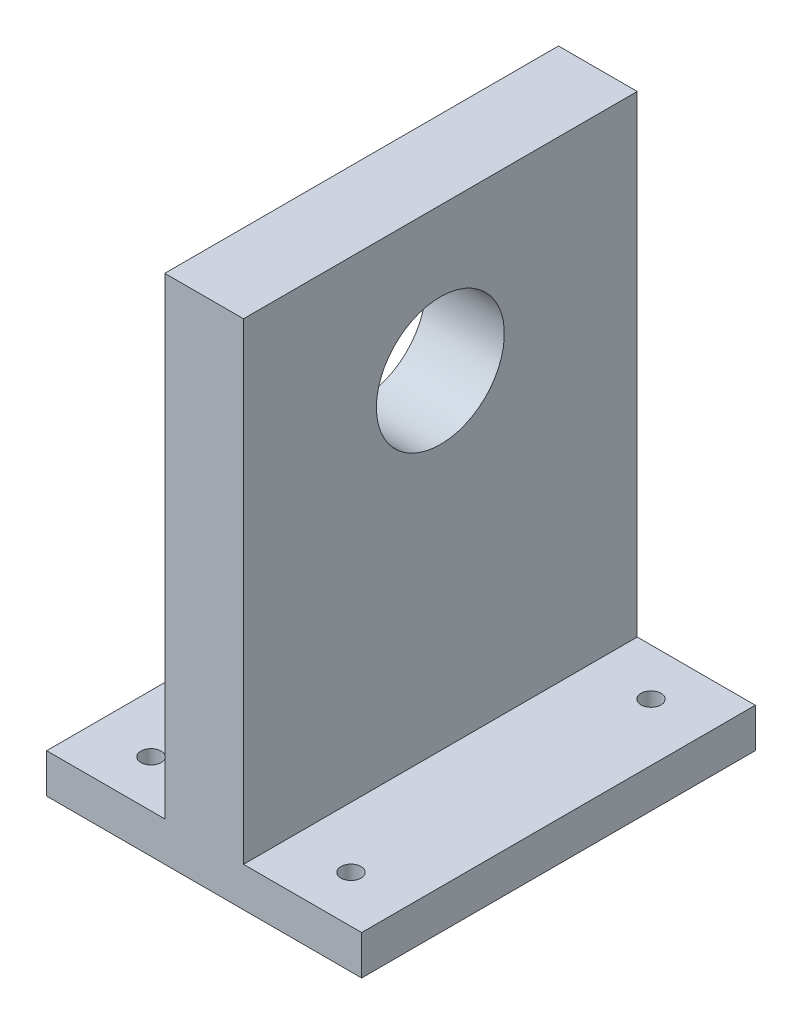
ISO-10303-21;
HEADER;
FILE_DESCRIPTION(('STEP AP214'),'2;1');
FILE_NAME('part.step','',(''),(''),'','','');
FILE_SCHEMA(('AUTOMOTIVE_DESIGN { 1 0 10303 214 1 1 1 1 }'));
ENDSEC;
DATA;
#1=APPLICATION_CONTEXT('core data for automotive mechanical design processes');
#2=APPLICATION_PROTOCOL_DEFINITION('international standard','automotive_design',2000,#1);
#3=PRODUCT_CONTEXT('',#1,'mechanical');
#4=PRODUCT('Part','Part','',(#3));
#5=PRODUCT_RELATED_PRODUCT_CATEGORY('part','',(#4));
#6=PRODUCT_DEFINITION_FORMATION('','',#4);
#7=PRODUCT_DEFINITION_CONTEXT('part definition',#1,'design');
#8=PRODUCT_DEFINITION('design','',#6,#7);
#9=PRODUCT_DEFINITION_SHAPE('','',#8);
#10=(LENGTH_UNIT() NAMED_UNIT(*) SI_UNIT(.MILLI.,.METRE.));
#11=(NAMED_UNIT(*) PLANE_ANGLE_UNIT() SI_UNIT($,.RADIAN.));
#12=(NAMED_UNIT(*) SI_UNIT($,.STERADIAN.) SOLID_ANGLE_UNIT());
#13=UNCERTAINTY_MEASURE_WITH_UNIT(LENGTH_MEASURE(1.E-05),#10,'distance_accuracy_value','');
#14=(GEOMETRIC_REPRESENTATION_CONTEXT(3) GLOBAL_UNCERTAINTY_ASSIGNED_CONTEXT((#13)) GLOBAL_UNIT_ASSIGNED_CONTEXT((#10,
#11,#12)) REPRESENTATION_CONTEXT('',''));
#15=CARTESIAN_POINT('',(0.,0.,0.));
#16=DIRECTION('',(0.,0.,1.));
#17=DIRECTION('',(1.,0.,0.));
#18=AXIS2_PLACEMENT_3D('',#15,#16,#17);
#19=CARTESIAN_POINT('',(0.,10.,0.));
#20=DIRECTION('',(0.,1.,0.));
#21=DIRECTION('',(0.,0.,1.));
#22=AXIS2_PLACEMENT_3D('',#19,#20,#21);
#23=PLANE('',#22);
#24=CARTESIAN_POINT('',(25.4,10.,-38.1));
#25=DIRECTION('',(0.,1.,0.));
#26=DIRECTION('',(0.,0.,1.));
#27=AXIS2_PLACEMENT_3D('',#24,#25,#26);
#28=CIRCLE('',#27,2.555);
#29=CARTESIAN_POINT('',(25.4,10.,-35.545));
#30=VERTEX_POINT('',#29);
#31=EDGE_CURVE('E218',#30,#30,#28,.F.);
#32=ORIENTED_EDGE('',*,*,#31,.T.);
#33=EDGE_LOOP('',(#32));
#34=FACE_BOUND('',#33,.T.);
#35=DIRECTION('',(0.,0.,-1.));
#36=VECTOR('',#35,1.);
#37=CARTESIAN_POINT('',(10.,10.,50.));
#38=LINE('',#37,#36);
#39=CARTESIAN_POINT('',(10.,10.,50.));
#40=VERTEX_POINT('',#39);
#41=CARTESIAN_POINT('',(10.,10.,-50.));
#42=VERTEX_POINT('',#41);
#43=EDGE_CURVE('E136',#40,#42,#38,.T.);
#44=ORIENTED_EDGE('',*,*,#43,.F.);
#45=DIRECTION('',(1.,0.,0.));
#46=VECTOR('',#45,1.);
#47=CARTESIAN_POINT('',(-40.,10.,50.));
#48=LINE('',#47,#46);
#49=CARTESIAN_POINT('',(40.,10.,50.));
#50=VERTEX_POINT('',#49);
#51=EDGE_CURVE('E153',#40,#50,#48,.T.);
#52=ORIENTED_EDGE('',*,*,#51,.T.);
#53=DIRECTION('',(0.,0.,-1.));
#54=VECTOR('',#53,1.);
#55=CARTESIAN_POINT('',(40.,10.,50.));
#56=LINE('',#55,#54);
#57=CARTESIAN_POINT('',(40.,10.,-50.));
#58=VERTEX_POINT('',#57);
#59=EDGE_CURVE('E152',#50,#58,#56,.T.);
#60=ORIENTED_EDGE('',*,*,#59,.T.);
#61=DIRECTION('',(1.,0.,0.));
#62=VECTOR('',#61,1.);
#63=CARTESIAN_POINT('',(-40.,10.,-50.));
#64=LINE('',#63,#62);
#65=EDGE_CURVE('E61',#42,#58,#64,.T.);
#66=ORIENTED_EDGE('',*,*,#65,.F.);
#67=EDGE_LOOP('',(#44,#52,#60,#66));
#68=FACE_BOUND('',#67,.T.);
#69=CARTESIAN_POINT('',(25.4,10.,38.1));
#70=DIRECTION('',(0.,1.,0.));
#71=DIRECTION('',(0.,0.,1.));
#72=AXIS2_PLACEMENT_3D('',#69,#70,#71);
#73=CIRCLE('',#72,2.555);
#74=CARTESIAN_POINT('',(25.4,10.,40.655));
#75=VERTEX_POINT('',#74);
#76=EDGE_CURVE('E210',#75,#75,#73,.T.);
#77=ORIENTED_EDGE('',*,*,#76,.F.);
#78=EDGE_LOOP('',(#77));
#79=FACE_BOUND('',#78,.T.);
#80=ADVANCED_FACE('F45',(#34,#68,#79),#23,.T.);
#81=CARTESIAN_POINT('',(-25.4,10.,38.1));
#82=DIRECTION('',(0.,1.,0.));
#83=DIRECTION('',(0.,0.,1.));
#84=AXIS2_PLACEMENT_3D('',#81,#82,#83);
#85=CIRCLE('',#84,2.555);
#86=CARTESIAN_POINT('',(-25.4,10.,40.655));
#87=VERTEX_POINT('',#86);
#88=EDGE_CURVE('E226',#87,#87,#85,.F.);
#89=ORIENTED_EDGE('',*,*,#88,.T.);
#90=EDGE_LOOP('',(#89));
#91=FACE_BOUND('',#90,.T.);
#92=DIRECTION('',(0.,0.,1.));
#93=VECTOR('',#92,1.);
#94=CARTESIAN_POINT('',(-10.,10.,50.));
#95=LINE('',#94,#93);
#96=CARTESIAN_POINT('',(-10.,10.,-50.));
#97=VERTEX_POINT('',#96);
#98=CARTESIAN_POINT('',(-10.,10.,50.));
#99=VERTEX_POINT('',#98);
#100=EDGE_CURVE('E69',#97,#99,#95,.T.);
#101=ORIENTED_EDGE('',*,*,#100,.F.);
#102=CARTESIAN_POINT('',(-40.,10.,-50.));
#103=VERTEX_POINT('',#102);
#104=EDGE_CURVE('E156',#103,#97,#64,.T.);
#105=ORIENTED_EDGE('',*,*,#104,.F.);
#106=DIRECTION('',(0.,0.,-1.));
#107=VECTOR('',#106,1.);
#108=CARTESIAN_POINT('',(-40.,10.,50.));
#109=LINE('',#108,#107);
#110=CARTESIAN_POINT('',(-40.,10.,50.));
#111=VERTEX_POINT('',#110);
#112=EDGE_CURVE('E159',#111,#103,#109,.T.);
#113=ORIENTED_EDGE('',*,*,#112,.F.);
#114=EDGE_CURVE('E149',#111,#99,#48,.T.);
#115=ORIENTED_EDGE('',*,*,#114,.T.);
#116=EDGE_LOOP('',(#101,#105,#113,#115));
#117=FACE_BOUND('',#116,.T.);
#118=CARTESIAN_POINT('',(-25.4,10.,-38.1));
#119=DIRECTION('',(0.,1.,0.));
#120=DIRECTION('',(0.,0.,1.));
#121=AXIS2_PLACEMENT_3D('',#118,#119,#120);
#122=CIRCLE('',#121,2.555);
#123=CARTESIAN_POINT('',(-25.4,10.,-35.545));
#124=VERTEX_POINT('',#123);
#125=EDGE_CURVE('E222',#124,#124,#122,.T.);
#126=ORIENTED_EDGE('',*,*,#125,.F.);
#127=EDGE_LOOP('',(#126));
#128=FACE_BOUND('',#127,.T.);
#129=ADVANCED_FACE('F194',(#91,#117,#128),#23,.T.);
#130=CARTESIAN_POINT('',(0.,0.,0.));
#131=DIRECTION('',(0.,1.,0.));
#132=DIRECTION('',(0.,0.,1.));
#133=AXIS2_PLACEMENT_3D('',#130,#131,#132);
#134=PLANE('',#133);
#135=CARTESIAN_POINT('',(-25.4,0.,-38.1));
#136=DIRECTION('',(0.,-1.,0.));
#137=DIRECTION('',(0.,0.,-1.));
#138=AXIS2_PLACEMENT_3D('',#135,#136,#137);
#139=CIRCLE('',#138,2.555);
#140=CARTESIAN_POINT('',(-25.4,0.,-40.655));
#141=VERTEX_POINT('',#140);
#142=EDGE_CURVE('E234',#141,#141,#139,.T.);
#143=ORIENTED_EDGE('',*,*,#142,.F.);
#144=EDGE_LOOP('',(#143));
#145=FACE_BOUND('',#144,.T.);
#146=CARTESIAN_POINT('',(-25.4,0.,38.1));
#147=DIRECTION('',(0.,1.,0.));
#148=DIRECTION('',(0.,0.,1.));
#149=AXIS2_PLACEMENT_3D('',#146,#147,#148);
#150=CIRCLE('',#149,2.555);
#151=CARTESIAN_POINT('',(-25.4,0.,40.655));
#152=VERTEX_POINT('',#151);
#153=EDGE_CURVE('E230',#152,#152,#150,.T.);
#154=ORIENTED_EDGE('',*,*,#153,.T.);
#155=EDGE_LOOP('',(#154));
#156=FACE_BOUND('',#155,.T.);
#157=DIRECTION('',(1.,0.,0.));
#158=VECTOR('',#157,1.);
#159=CARTESIAN_POINT('',(-40.,0.,50.));
#160=LINE('',#159,#158);
#161=CARTESIAN_POINT('',(-40.,0.,50.));
#162=VERTEX_POINT('',#161);
#163=CARTESIAN_POINT('',(40.,0.,50.));
#164=VERTEX_POINT('',#163);
#165=EDGE_CURVE('E138',#162,#164,#160,.T.);
#166=ORIENTED_EDGE('',*,*,#165,.F.);
#167=DIRECTION('',(0.,0.,-1.));
#168=VECTOR('',#167,1.);
#169=CARTESIAN_POINT('',(-40.,0.,50.));
#170=LINE('',#169,#168);
#171=CARTESIAN_POINT('',(-40.,0.,-50.));
#172=VERTEX_POINT('',#171);
#173=EDGE_CURVE('E171',#162,#172,#170,.T.);
#174=ORIENTED_EDGE('',*,*,#173,.T.);
#175=DIRECTION('',(1.,0.,0.));
#176=VECTOR('',#175,1.);
#177=CARTESIAN_POINT('',(-40.,0.,-50.));
#178=LINE('',#177,#176);
#179=CARTESIAN_POINT('',(40.,0.,-50.));
#180=VERTEX_POINT('',#179);
#181=EDGE_CURVE('E167',#172,#180,#178,.T.);
#182=ORIENTED_EDGE('',*,*,#181,.T.);
#183=DIRECTION('',(0.,0.,-1.));
#184=VECTOR('',#183,1.);
#185=CARTESIAN_POINT('',(40.,0.,50.));
#186=LINE('',#185,#184);
#187=EDGE_CURVE('E143',#164,#180,#186,.T.);
#188=ORIENTED_EDGE('',*,*,#187,.F.);
#189=EDGE_LOOP('',(#166,#174,#182,#188));
#190=FACE_BOUND('',#189,.T.);
#191=CARTESIAN_POINT('',(25.4,0.,-38.1));
#192=DIRECTION('',(0.,1.,0.));
#193=DIRECTION('',(0.,0.,1.));
#194=AXIS2_PLACEMENT_3D('',#191,#192,#193);
#195=CIRCLE('',#194,2.555);
#196=CARTESIAN_POINT('',(25.4,0.,-35.545));
#197=VERTEX_POINT('',#196);
#198=EDGE_CURVE('E239',#197,#197,#195,.T.);
#199=ORIENTED_EDGE('',*,*,#198,.T.);
#200=EDGE_LOOP('',(#199));
#201=FACE_BOUND('',#200,.T.);
#202=CARTESIAN_POINT('',(25.4,0.,38.1));
#203=DIRECTION('',(0.,-1.,0.));
#204=DIRECTION('',(0.,0.,-1.));
#205=AXIS2_PLACEMENT_3D('',#202,#203,#204);
#206=CIRCLE('',#205,2.555);
#207=CARTESIAN_POINT('',(25.4,0.,35.545));
#208=VERTEX_POINT('',#207);
#209=EDGE_CURVE('E235',#208,#208,#206,.T.);
#210=ORIENTED_EDGE('',*,*,#209,.F.);
#211=EDGE_LOOP('',(#210));
#212=FACE_BOUND('',#211,.T.);
#213=ADVANCED_FACE('F187',(#145,#156,#190,#201,#212),#134,.F.);
#214=CARTESIAN_POINT('',(-40.,10.,50.));
#215=DIRECTION('',(0.,0.,-1.));
#216=DIRECTION('',(-1.,0.,0.));
#217=AXIS2_PLACEMENT_3D('',#214,#215,#216);
#218=PLANE('',#217);
#219=ORIENTED_EDGE('',*,*,#165,.T.);
#220=DIRECTION('',(0.,-1.,0.));
#221=VECTOR('',#220,1.);
#222=CARTESIAN_POINT('',(40.,10.,50.));
#223=LINE('',#222,#221);
#224=EDGE_CURVE('E11',#50,#164,#223,.T.);
#225=ORIENTED_EDGE('',*,*,#224,.F.);
#226=ORIENTED_EDGE('',*,*,#51,.F.);
#227=DIRECTION('',(0.,-1.,0.));
#228=VECTOR('',#227,1.);
#229=CARTESIAN_POINT('',(10.,130.,50.));
#230=LINE('',#229,#228);
#231=CARTESIAN_POINT('',(10.,130.,50.));
#232=VERTEX_POINT('',#231);
#233=EDGE_CURVE('E204',#232,#40,#230,.T.);
#234=ORIENTED_EDGE('',*,*,#233,.F.);
#235=DIRECTION('',(1.,0.,0.));
#236=VECTOR('',#235,1.);
#237=CARTESIAN_POINT('',(-10.,130.,50.));
#238=LINE('',#237,#236);
#239=CARTESIAN_POINT('',(-10.,130.,50.));
#240=VERTEX_POINT('',#239);
#241=EDGE_CURVE('E129',#240,#232,#238,.T.);
#242=ORIENTED_EDGE('',*,*,#241,.F.);
#243=DIRECTION('',(0.,-1.,0.));
#244=VECTOR('',#243,1.);
#245=CARTESIAN_POINT('',(-10.,130.,50.));
#246=LINE('',#245,#244);
#247=EDGE_CURVE('E145',#240,#99,#246,.T.);
#248=ORIENTED_EDGE('',*,*,#247,.T.);
#249=ORIENTED_EDGE('',*,*,#114,.F.);
#250=DIRECTION('',(0.,-1.,0.));
#251=VECTOR('',#250,1.);
#252=CARTESIAN_POINT('',(-40.,10.,50.));
#253=LINE('',#252,#251);
#254=EDGE_CURVE('E162',#111,#162,#253,.T.);
#255=ORIENTED_EDGE('',*,*,#254,.T.);
#256=EDGE_LOOP('',(#219,#225,#226,#234,#242,#248,#249,#255));
#257=FACE_BOUND('',#256,.T.);
#258=ADVANCED_FACE('F47',(#257),#218,.F.);
#259=CARTESIAN_POINT('',(40.,10.,50.));
#260=DIRECTION('',(-1.,0.,0.));
#261=DIRECTION('',(0.,0.,1.));
#262=AXIS2_PLACEMENT_3D('',#259,#260,#261);
#263=PLANE('',#262);
#264=ORIENTED_EDGE('',*,*,#187,.T.);
#265=DIRECTION('',(0.,-1.,0.));
#266=VECTOR('',#265,1.);
#267=CARTESIAN_POINT('',(40.,10.,-50.));
#268=LINE('',#267,#266);
#269=EDGE_CURVE('E54',#58,#180,#268,.T.);
#270=ORIENTED_EDGE('',*,*,#269,.F.);
#271=ORIENTED_EDGE('',*,*,#59,.F.);
#272=ORIENTED_EDGE('',*,*,#224,.T.);
#273=EDGE_LOOP('',(#264,#270,#271,#272));
#274=FACE_BOUND('',#273,.T.);
#275=ADVANCED_FACE('F183',(#274),#263,.F.);
#276=CARTESIAN_POINT('',(-40.,10.,-50.));
#277=DIRECTION('',(0.,0.,-1.));
#278=DIRECTION('',(-1.,0.,0.));
#279=AXIS2_PLACEMENT_3D('',#276,#277,#278);
#280=PLANE('',#279);
#281=ORIENTED_EDGE('',*,*,#181,.F.);
#282=DIRECTION('',(0.,-1.,0.));
#283=VECTOR('',#282,1.);
#284=CARTESIAN_POINT('',(-40.,10.,-50.));
#285=LINE('',#284,#283);
#286=EDGE_CURVE('E177',#103,#172,#285,.T.);
#287=ORIENTED_EDGE('',*,*,#286,.F.);
#288=ORIENTED_EDGE('',*,*,#104,.T.);
#289=DIRECTION('',(0.,-1.,0.));
#290=VECTOR('',#289,1.);
#291=CARTESIAN_POINT('',(-10.,130.,-50.));
#292=LINE('',#291,#290);
#293=CARTESIAN_POINT('',(-10.,130.,-50.));
#294=VERTEX_POINT('',#293);
#295=EDGE_CURVE('E119',#294,#97,#292,.T.);
#296=ORIENTED_EDGE('',*,*,#295,.F.);
#297=DIRECTION('',(-1.,0.,0.));
#298=VECTOR('',#297,1.);
#299=CARTESIAN_POINT('',(-10.,130.,-50.));
#300=LINE('',#299,#298);
#301=CARTESIAN_POINT('',(10.,130.,-50.));
#302=VERTEX_POINT('',#301);
#303=EDGE_CURVE('E111',#302,#294,#300,.T.);
#304=ORIENTED_EDGE('',*,*,#303,.F.);
#305=DIRECTION('',(0.,-1.,0.));
#306=VECTOR('',#305,1.);
#307=CARTESIAN_POINT('',(10.,130.,-50.));
#308=LINE('',#307,#306);
#309=EDGE_CURVE('E116',#302,#42,#308,.T.);
#310=ORIENTED_EDGE('',*,*,#309,.T.);
#311=ORIENTED_EDGE('',*,*,#65,.T.);
#312=ORIENTED_EDGE('',*,*,#269,.T.);
#313=EDGE_LOOP('',(#281,#287,#288,#296,#304,#310,#311,#312));
#314=FACE_BOUND('',#313,.T.);
#315=ADVANCED_FACE('F114',(#314),#280,.T.);
#316=CARTESIAN_POINT('',(-40.,10.,50.));
#317=DIRECTION('',(-1.,0.,0.));
#318=DIRECTION('',(0.,0.,1.));
#319=AXIS2_PLACEMENT_3D('',#316,#317,#318);
#320=PLANE('',#319);
#321=ORIENTED_EDGE('',*,*,#173,.F.);
#322=ORIENTED_EDGE('',*,*,#254,.F.);
#323=ORIENTED_EDGE('',*,*,#112,.T.);
#324=ORIENTED_EDGE('',*,*,#286,.T.);
#325=EDGE_LOOP('',(#321,#322,#323,#324));
#326=FACE_BOUND('',#325,.T.);
#327=ADVANCED_FACE('F191',(#326),#320,.T.);
#328=CARTESIAN_POINT('',(10.,130.,50.));
#329=DIRECTION('',(-1.,0.,0.));
#330=DIRECTION('',(0.,0.,1.));
#331=AXIS2_PLACEMENT_3D('',#328,#329,#330);
#332=PLANE('',#331);
#333=CARTESIAN_POINT('',(10.,93.5871356281289,0.));
#334=DIRECTION('',(-1.,0.,0.));
#335=DIRECTION('',(0.,0.,1.));
#336=AXIS2_PLACEMENT_3D('',#333,#334,#335);
#337=CIRCLE('',#336,16.25);
#338=CARTESIAN_POINT('',(10.,93.5871356281289,16.25));
#339=VERTEX_POINT('',#338);
#340=EDGE_CURVE('E240',#339,#339,#337,.T.);
#341=ORIENTED_EDGE('',*,*,#340,.T.);
#342=EDGE_LOOP('',(#341));
#343=FACE_BOUND('',#342,.T.);
#344=ORIENTED_EDGE('',*,*,#43,.T.);
#345=ORIENTED_EDGE('',*,*,#309,.F.);
#346=DIRECTION('',(0.,0.,-1.));
#347=VECTOR('',#346,1.);
#348=CARTESIAN_POINT('',(10.,130.,50.));
#349=LINE('',#348,#347);
#350=EDGE_CURVE('E124',#232,#302,#349,.T.);
#351=ORIENTED_EDGE('',*,*,#350,.F.);
#352=ORIENTED_EDGE('',*,*,#233,.T.);
#353=EDGE_LOOP('',(#344,#345,#351,#352));
#354=FACE_BOUND('',#353,.T.);
#355=ADVANCED_FACE('F135',(#343,#354),#332,.F.);
#356=CARTESIAN_POINT('',(-10.,130.,50.));
#357=DIRECTION('',(1.,0.,0.));
#358=DIRECTION('',(0.,0.,-1.));
#359=AXIS2_PLACEMENT_3D('',#356,#357,#358);
#360=PLANE('',#359);
#361=CARTESIAN_POINT('',(-10.,93.5871356281289,0.));
#362=DIRECTION('',(-1.,0.,0.));
#363=DIRECTION('',(0.,0.,1.));
#364=AXIS2_PLACEMENT_3D('',#361,#362,#363);
#365=CIRCLE('',#364,16.25);
#366=CARTESIAN_POINT('',(-10.,93.5871356281289,16.25));
#367=VERTEX_POINT('',#366);
#368=EDGE_CURVE('E250',#367,#367,#365,.T.);
#369=ORIENTED_EDGE('',*,*,#368,.F.);
#370=EDGE_LOOP('',(#369));
#371=FACE_BOUND('',#370,.T.);
#372=ORIENTED_EDGE('',*,*,#100,.T.);
#373=ORIENTED_EDGE('',*,*,#247,.F.);
#374=DIRECTION('',(0.,0.,1.));
#375=VECTOR('',#374,1.);
#376=CARTESIAN_POINT('',(-10.,130.,50.));
#377=LINE('',#376,#375);
#378=EDGE_CURVE('E123',#294,#240,#377,.T.);
#379=ORIENTED_EDGE('',*,*,#378,.F.);
#380=ORIENTED_EDGE('',*,*,#295,.T.);
#381=EDGE_LOOP('',(#372,#373,#379,#380));
#382=FACE_BOUND('',#381,.T.);
#383=ADVANCED_FACE('F200',(#371,#382),#360,.F.);
#384=CARTESIAN_POINT('',(0.,130.,0.));
#385=DIRECTION('',(0.,-1.,0.));
#386=DIRECTION('',(0.,0.,-1.));
#387=AXIS2_PLACEMENT_3D('',#384,#385,#386);
#388=PLANE('',#387);
#389=ORIENTED_EDGE('',*,*,#350,.T.);
#390=ORIENTED_EDGE('',*,*,#303,.T.);
#391=ORIENTED_EDGE('',*,*,#378,.T.);
#392=ORIENTED_EDGE('',*,*,#241,.T.);
#393=EDGE_LOOP('',(#389,#390,#391,#392));
#394=FACE_BOUND('',#393,.T.);
#395=ADVANCED_FACE('F127',(#394),#388,.F.);
#396=CARTESIAN_POINT('',(-25.4,55.,38.1));
#397=DIRECTION('',(0.,-1.,0.));
#398=DIRECTION('',(0.,0.,-1.));
#399=AXIS2_PLACEMENT_3D('',#396,#397,#398);
#400=CYLINDRICAL_SURFACE('',#399,2.555);
#401=ORIENTED_EDGE('',*,*,#88,.F.);
#402=EDGE_LOOP('',(#401));
#403=FACE_BOUND('',#402,.T.);
#404=ORIENTED_EDGE('',*,*,#153,.F.);
#405=EDGE_LOOP('',(#404));
#406=FACE_BOUND('',#405,.T.);
#407=ADVANCED_FACE('F265',(#403,#406),#400,.F.);
#408=CARTESIAN_POINT('',(-25.4,55.,-38.1));
#409=DIRECTION('',(0.,-1.,0.));
#410=DIRECTION('',(0.,0.,-1.));
#411=AXIS2_PLACEMENT_3D('',#408,#409,#410);
#412=CYLINDRICAL_SURFACE('',#411,2.555);
#413=ORIENTED_EDGE('',*,*,#125,.T.);
#414=EDGE_LOOP('',(#413));
#415=FACE_BOUND('',#414,.T.);
#416=ORIENTED_EDGE('',*,*,#142,.T.);
#417=EDGE_LOOP('',(#416));
#418=FACE_BOUND('',#417,.T.);
#419=ADVANCED_FACE('F330',(#415,#418),#412,.F.);
#420=CARTESIAN_POINT('',(25.4,55.,-38.1));
#421=DIRECTION('',(0.,-1.,0.));
#422=DIRECTION('',(0.,0.,-1.));
#423=AXIS2_PLACEMENT_3D('',#420,#421,#422);
#424=CYLINDRICAL_SURFACE('',#423,2.555);
#425=ORIENTED_EDGE('',*,*,#31,.F.);
#426=EDGE_LOOP('',(#425));
#427=FACE_BOUND('',#426,.T.);
#428=ORIENTED_EDGE('',*,*,#198,.F.);
#429=EDGE_LOOP('',(#428));
#430=FACE_BOUND('',#429,.T.);
#431=ADVANCED_FACE('F340',(#427,#430),#424,.F.);
#432=CARTESIAN_POINT('',(25.4,55.,38.1));
#433=DIRECTION('',(0.,-1.,0.));
#434=DIRECTION('',(0.,0.,-1.));
#435=AXIS2_PLACEMENT_3D('',#432,#433,#434);
#436=CYLINDRICAL_SURFACE('',#435,2.555);
#437=ORIENTED_EDGE('',*,*,#76,.T.);
#438=EDGE_LOOP('',(#437));
#439=FACE_BOUND('',#438,.T.);
#440=ORIENTED_EDGE('',*,*,#209,.T.);
#441=EDGE_LOOP('',(#440));
#442=FACE_BOUND('',#441,.T.);
#443=ADVANCED_FACE('F350',(#439,#442),#436,.F.);
#444=CARTESIAN_POINT('',(35.,93.5871356281289,0.));
#445=DIRECTION('',(-1.,0.,0.));
#446=DIRECTION('',(0.,0.,1.));
#447=AXIS2_PLACEMENT_3D('',#444,#445,#446);
#448=CYLINDRICAL_SURFACE('',#447,16.25);
#449=ORIENTED_EDGE('',*,*,#368,.T.);
#450=EDGE_LOOP('',(#449));
#451=FACE_BOUND('',#450,.T.);
#452=ORIENTED_EDGE('',*,*,#340,.F.);
#453=EDGE_LOOP('',(#452));
#454=FACE_BOUND('',#453,.T.);
#455=ADVANCED_FACE('F255',(#451,#454),#448,.F.);
#456=CLOSED_SHELL('',(#80,#129,#213,#258,#275,#315,#327,#355,#383,#395,#407,#419,#431,#443,#455));
#457=MANIFOLD_SOLID_BREP('B2',#456);
#458=ADVANCED_BREP_SHAPE_REPRESENTATION('',(#18,#457),#14);
#459=SHAPE_DEFINITION_REPRESENTATION(#9,#458);
ENDSEC;
END-ISO-10303-21;
